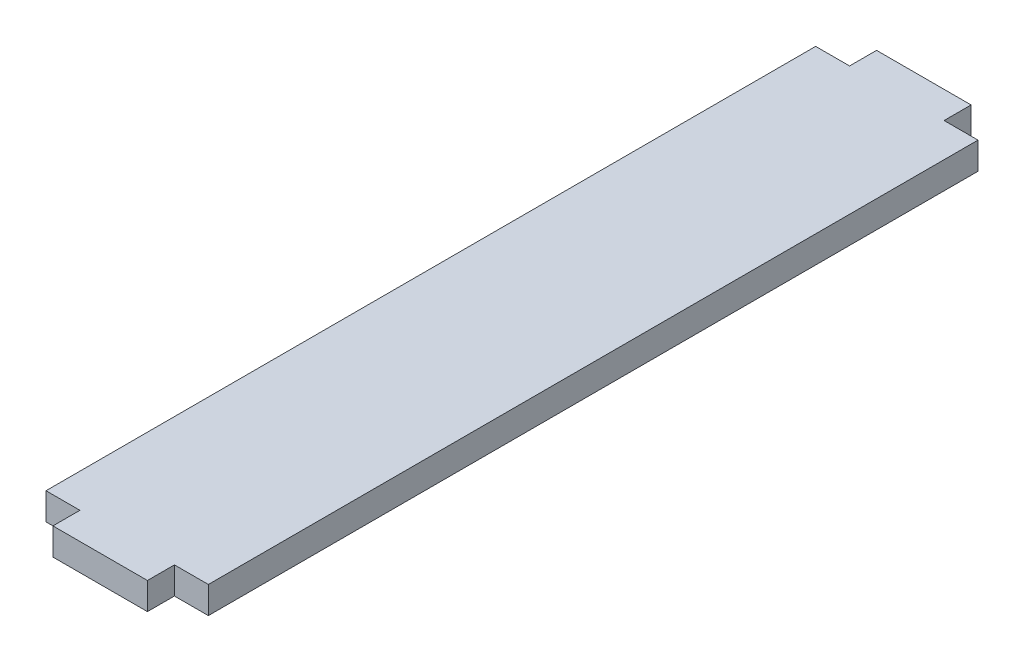
ISO-10303-21;
HEADER;
FILE_DESCRIPTION(('STEP AP214'),'2;1');
FILE_NAME('part.step','',(''),(''),'','','');
FILE_SCHEMA(('AUTOMOTIVE_DESIGN { 1 0 10303 214 1 1 1 1 }'));
ENDSEC;
DATA;
#1=APPLICATION_CONTEXT('core data for automotive mechanical design processes');
#2=APPLICATION_PROTOCOL_DEFINITION('international standard','automotive_design',2000,#1);
#3=PRODUCT_CONTEXT('',#1,'mechanical');
#4=PRODUCT('Part','Part','',(#3));
#5=PRODUCT_RELATED_PRODUCT_CATEGORY('part','',(#4));
#6=PRODUCT_DEFINITION_FORMATION('','',#4);
#7=PRODUCT_DEFINITION_CONTEXT('part definition',#1,'design');
#8=PRODUCT_DEFINITION('design','',#6,#7);
#9=PRODUCT_DEFINITION_SHAPE('','',#8);
#10=(LENGTH_UNIT() NAMED_UNIT(*) SI_UNIT(.MILLI.,.METRE.));
#11=(NAMED_UNIT(*) PLANE_ANGLE_UNIT() SI_UNIT($,.RADIAN.));
#12=(NAMED_UNIT(*) SI_UNIT($,.STERADIAN.) SOLID_ANGLE_UNIT());
#13=UNCERTAINTY_MEASURE_WITH_UNIT(LENGTH_MEASURE(1.E-05),#10,'distance_accuracy_value','');
#14=(GEOMETRIC_REPRESENTATION_CONTEXT(3) GLOBAL_UNCERTAINTY_ASSIGNED_CONTEXT((#13)) GLOBAL_UNIT_ASSIGNED_CONTEXT((#10,
#11,#12)) REPRESENTATION_CONTEXT('',''));
#15=CARTESIAN_POINT('',(0.,0.,0.));
#16=DIRECTION('',(0.,0.,1.));
#17=DIRECTION('',(1.,0.,0.));
#18=AXIS2_PLACEMENT_3D('',#15,#16,#17);
#19=CARTESIAN_POINT('',(0.,5.08,-144.78));
#20=DIRECTION('',(0.,0.,1.));
#21=DIRECTION('',(1.,0.,0.));
#22=AXIS2_PLACEMENT_3D('',#19,#20,#21);
#23=PLANE('',#22);
#24=DIRECTION('',(0.,1.,0.));
#25=VECTOR('',#24,1.);
#26=CARTESIAN_POINT('',(-24.16,0.,-144.78));
#27=LINE('',#26,#25);
#28=CARTESIAN_POINT('',(-24.16,0.,-144.78));
#29=VERTEX_POINT('',#28);
#30=CARTESIAN_POINT('',(-24.16,5.08,-144.78));
#31=VERTEX_POINT('',#30);
#32=EDGE_CURVE('E144',#29,#31,#27,.T.);
#33=ORIENTED_EDGE('',*,*,#32,.F.);
#34=DIRECTION('',(-1.,0.,0.));
#35=VECTOR('',#34,1.);
#36=CARTESIAN_POINT('',(0.,0.,-144.78));
#37=LINE('',#36,#35);
#38=CARTESIAN_POINT('',(-30.54,0.,-144.78));
#39=VERTEX_POINT('',#38);
#40=EDGE_CURVE('E192',#29,#39,#37,.T.);
#41=ORIENTED_EDGE('',*,*,#40,.T.);
#42=DIRECTION('',(0.,-1.,0.));
#43=VECTOR('',#42,1.);
#44=CARTESIAN_POINT('',(-30.54,5.08,-144.78));
#45=LINE('',#44,#43);
#46=CARTESIAN_POINT('',(-30.54,5.08,-144.78));
#47=VERTEX_POINT('',#46);
#48=EDGE_CURVE('E41',#47,#39,#45,.T.);
#49=ORIENTED_EDGE('',*,*,#48,.F.);
#50=DIRECTION('',(-1.,0.,0.));
#51=VECTOR('',#50,1.);
#52=CARTESIAN_POINT('',(0.,5.08,-144.78));
#53=LINE('',#52,#51);
#54=EDGE_CURVE('E48',#31,#47,#53,.T.);
#55=ORIENTED_EDGE('',*,*,#54,.F.);
#56=EDGE_LOOP('',(#33,#41,#49,#55));
#57=FACE_BOUND('',#56,.T.);
#58=ADVANCED_FACE('F33',(#57),#23,.F.);
#59=DIRECTION('',(0.,-1.,0.));
#60=VECTOR('',#59,1.);
#61=CARTESIAN_POINT('',(-6.38,0.,-144.78));
#62=LINE('',#61,#60);
#63=CARTESIAN_POINT('',(-6.38,5.08,-144.78));
#64=VERTEX_POINT('',#63);
#65=CARTESIAN_POINT('',(-6.38,0.,-144.78));
#66=VERTEX_POINT('',#65);
#67=EDGE_CURVE('E56',#64,#66,#62,.T.);
#68=ORIENTED_EDGE('',*,*,#67,.F.);
#69=CARTESIAN_POINT('',(0.,5.08,-144.78));
#70=VERTEX_POINT('',#69);
#71=EDGE_CURVE('E181',#70,#64,#53,.T.);
#72=ORIENTED_EDGE('',*,*,#71,.F.);
#73=DIRECTION('',(0.,-1.,0.));
#74=VECTOR('',#73,1.);
#75=CARTESIAN_POINT('',(0.,5.08,-144.78));
#76=LINE('',#75,#74);
#77=CARTESIAN_POINT('',(0.,0.,-144.78));
#78=VERTEX_POINT('',#77);
#79=EDGE_CURVE('E11',#70,#78,#76,.T.);
#80=ORIENTED_EDGE('',*,*,#79,.T.);
#81=EDGE_CURVE('E193',#78,#66,#37,.T.);
#82=ORIENTED_EDGE('',*,*,#81,.T.);
#83=EDGE_LOOP('',(#68,#72,#80,#82));
#84=FACE_BOUND('',#83,.T.);
#85=ADVANCED_FACE('F256',(#84),#23,.F.);
#86=CARTESIAN_POINT('',(0.,5.08,0.));
#87=DIRECTION('',(0.,0.,-1.));
#88=DIRECTION('',(-1.,0.,0.));
#89=AXIS2_PLACEMENT_3D('',#86,#87,#88);
#90=PLANE('',#89);
#91=DIRECTION('',(0.,1.,0.));
#92=VECTOR('',#91,1.);
#93=CARTESIAN_POINT('',(-6.38,0.,0.));
#94=LINE('',#93,#92);
#95=CARTESIAN_POINT('',(-6.38,0.,0.));
#96=VERTEX_POINT('',#95);
#97=CARTESIAN_POINT('',(-6.38,5.08,0.));
#98=VERTEX_POINT('',#97);
#99=EDGE_CURVE('E145',#96,#98,#94,.T.);
#100=ORIENTED_EDGE('',*,*,#99,.F.);
#101=DIRECTION('',(1.,0.,0.));
#102=VECTOR('',#101,1.);
#103=CARTESIAN_POINT('',(0.,0.,0.));
#104=LINE('',#103,#102);
#105=CARTESIAN_POINT('',(0.,0.,0.));
#106=VERTEX_POINT('',#105);
#107=EDGE_CURVE('E197',#96,#106,#104,.T.);
#108=ORIENTED_EDGE('',*,*,#107,.T.);
#109=DIRECTION('',(0.,-1.,0.));
#110=VECTOR('',#109,1.);
#111=CARTESIAN_POINT('',(0.,5.08,0.));
#112=LINE('',#111,#110);
#113=CARTESIAN_POINT('',(0.,5.08,0.));
#114=VERTEX_POINT('',#113);
#115=EDGE_CURVE('E189',#114,#106,#112,.T.);
#116=ORIENTED_EDGE('',*,*,#115,.F.);
#117=DIRECTION('',(1.,0.,0.));
#118=VECTOR('',#117,1.);
#119=CARTESIAN_POINT('',(0.,5.08,0.));
#120=LINE('',#119,#118);
#121=EDGE_CURVE('E185',#98,#114,#120,.T.);
#122=ORIENTED_EDGE('',*,*,#121,.F.);
#123=EDGE_LOOP('',(#100,#108,#116,#122));
#124=FACE_BOUND('',#123,.T.);
#125=ADVANCED_FACE('F232',(#124),#90,.F.);
#126=DIRECTION('',(0.,-1.,0.));
#127=VECTOR('',#126,1.);
#128=CARTESIAN_POINT('',(-24.16,0.,0.));
#129=LINE('',#128,#127);
#130=CARTESIAN_POINT('',(-24.16,5.08,0.));
#131=VERTEX_POINT('',#130);
#132=CARTESIAN_POINT('',(-24.16,0.,0.));
#133=VERTEX_POINT('',#132);
#134=EDGE_CURVE('E148',#131,#133,#129,.T.);
#135=ORIENTED_EDGE('',*,*,#134,.F.);
#136=CARTESIAN_POINT('',(-30.54,5.08,0.));
#137=VERTEX_POINT('',#136);
#138=EDGE_CURVE('E186',#137,#131,#120,.T.);
#139=ORIENTED_EDGE('',*,*,#138,.F.);
#140=DIRECTION('',(0.,-1.,0.));
#141=VECTOR('',#140,1.);
#142=CARTESIAN_POINT('',(-30.54,5.08,0.));
#143=LINE('',#142,#141);
#144=CARTESIAN_POINT('',(-30.54,0.,0.));
#145=VERTEX_POINT('',#144);
#146=EDGE_CURVE('E201',#137,#145,#143,.T.);
#147=ORIENTED_EDGE('',*,*,#146,.T.);
#148=EDGE_CURVE('E180',#145,#133,#104,.T.);
#149=ORIENTED_EDGE('',*,*,#148,.T.);
#150=EDGE_LOOP('',(#135,#139,#147,#149));
#151=FACE_BOUND('',#150,.T.);
#152=ADVANCED_FACE('F217',(#151),#90,.F.);
#153=CARTESIAN_POINT('',(0.,5.08,0.));
#154=DIRECTION('',(-1.,0.,0.));
#155=DIRECTION('',(0.,0.,1.));
#156=AXIS2_PLACEMENT_3D('',#153,#154,#155);
#157=PLANE('',#156);
#158=DIRECTION('',(0.,0.,-1.));
#159=VECTOR('',#158,1.);
#160=CARTESIAN_POINT('',(0.,0.,0.));
#161=LINE('',#160,#159);
#162=EDGE_CURVE('E177',#106,#78,#161,.T.);
#163=ORIENTED_EDGE('',*,*,#162,.T.);
#164=ORIENTED_EDGE('',*,*,#79,.F.);
#165=DIRECTION('',(0.,0.,-1.));
#166=VECTOR('',#165,1.);
#167=CARTESIAN_POINT('',(0.,5.08,0.));
#168=LINE('',#167,#166);
#169=EDGE_CURVE('E178',#114,#70,#168,.T.);
#170=ORIENTED_EDGE('',*,*,#169,.F.);
#171=ORIENTED_EDGE('',*,*,#115,.T.);
#172=EDGE_LOOP('',(#163,#164,#170,#171));
#173=FACE_BOUND('',#172,.T.);
#174=ADVANCED_FACE('F35',(#173),#157,.F.);
#175=CARTESIAN_POINT('',(-30.54,5.08,0.));
#176=DIRECTION('',(1.,0.,0.));
#177=DIRECTION('',(0.,0.,-1.));
#178=AXIS2_PLACEMENT_3D('',#175,#176,#177);
#179=PLANE('',#178);
#180=DIRECTION('',(0.,0.,1.));
#181=VECTOR('',#180,1.);
#182=CARTESIAN_POINT('',(-30.54,0.,0.));
#183=LINE('',#182,#181);
#184=EDGE_CURVE('E195',#39,#145,#183,.T.);
#185=ORIENTED_EDGE('',*,*,#184,.T.);
#186=ORIENTED_EDGE('',*,*,#146,.F.);
#187=DIRECTION('',(0.,0.,1.));
#188=VECTOR('',#187,1.);
#189=CARTESIAN_POINT('',(-30.54,5.08,0.));
#190=LINE('',#189,#188);
#191=EDGE_CURVE('E183',#47,#137,#190,.T.);
#192=ORIENTED_EDGE('',*,*,#191,.F.);
#193=ORIENTED_EDGE('',*,*,#48,.T.);
#194=EDGE_LOOP('',(#185,#186,#192,#193));
#195=FACE_BOUND('',#194,.T.);
#196=ADVANCED_FACE('F207',(#195),#179,.F.);
#197=CARTESIAN_POINT('',(0.,5.08,0.));
#198=DIRECTION('',(0.,1.,0.));
#199=DIRECTION('',(0.,0.,1.));
#200=AXIS2_PLACEMENT_3D('',#197,#198,#199);
#201=PLANE('',#200);
#202=ORIENTED_EDGE('',*,*,#169,.T.);
#203=ORIENTED_EDGE('',*,*,#71,.T.);
#204=DIRECTION('',(0.,0.,1.));
#205=VECTOR('',#204,1.);
#206=CARTESIAN_POINT('',(-6.38,5.08,-149.86));
#207=LINE('',#206,#205);
#208=CARTESIAN_POINT('',(-6.38,5.08,-149.86));
#209=VERTEX_POINT('',#208);
#210=EDGE_CURVE('E129',#209,#64,#207,.T.);
#211=ORIENTED_EDGE('',*,*,#210,.F.);
#212=DIRECTION('',(1.,0.,0.));
#213=VECTOR('',#212,1.);
#214=CARTESIAN_POINT('',(-24.16,5.08,-149.86));
#215=LINE('',#214,#213);
#216=CARTESIAN_POINT('',(-24.16,5.08,-149.86));
#217=VERTEX_POINT('',#216);
#218=EDGE_CURVE('E121',#217,#209,#215,.T.);
#219=ORIENTED_EDGE('',*,*,#218,.F.);
#220=DIRECTION('',(0.,0.,1.));
#221=VECTOR('',#220,1.);
#222=CARTESIAN_POINT('',(-24.16,5.08,-149.86));
#223=LINE('',#222,#221);
#224=EDGE_CURVE('E126',#217,#31,#223,.T.);
#225=ORIENTED_EDGE('',*,*,#224,.T.);
#226=ORIENTED_EDGE('',*,*,#54,.T.);
#227=ORIENTED_EDGE('',*,*,#191,.T.);
#228=ORIENTED_EDGE('',*,*,#138,.T.);
#229=DIRECTION('',(0.,0.,-1.));
#230=VECTOR('',#229,1.);
#231=CARTESIAN_POINT('',(-24.16,5.08,5.08));
#232=LINE('',#231,#230);
#233=CARTESIAN_POINT('',(-24.16,5.08,5.08));
#234=VERTEX_POINT('',#233);
#235=EDGE_CURVE('E171',#234,#131,#232,.T.);
#236=ORIENTED_EDGE('',*,*,#235,.F.);
#237=DIRECTION('',(-1.,0.,0.));
#238=VECTOR('',#237,1.);
#239=CARTESIAN_POINT('',(-24.16,5.08,5.08));
#240=LINE('',#239,#238);
#241=CARTESIAN_POINT('',(-6.38,5.08,5.08));
#242=VERTEX_POINT('',#241);
#243=EDGE_CURVE('E157',#242,#234,#240,.T.);
#244=ORIENTED_EDGE('',*,*,#243,.F.);
#245=DIRECTION('',(0.,0.,-1.));
#246=VECTOR('',#245,1.);
#247=CARTESIAN_POINT('',(-6.38,5.08,5.08));
#248=LINE('',#247,#246);
#249=EDGE_CURVE('E174',#242,#98,#248,.T.);
#250=ORIENTED_EDGE('',*,*,#249,.T.);
#251=ORIENTED_EDGE('',*,*,#121,.T.);
#252=EDGE_LOOP('',(#202,#203,#211,#219,#225,#226,#227,#228,#236,#244,#250,#251));
#253=FACE_BOUND('',#252,.T.);
#254=ADVANCED_FACE('F124',(#253),#201,.T.);
#255=CARTESIAN_POINT('',(0.,0.,0.));
#256=DIRECTION('',(0.,1.,0.));
#257=DIRECTION('',(0.,0.,1.));
#258=AXIS2_PLACEMENT_3D('',#255,#256,#257);
#259=PLANE('',#258);
#260=ORIENTED_EDGE('',*,*,#162,.F.);
#261=ORIENTED_EDGE('',*,*,#107,.F.);
#262=DIRECTION('',(0.,0.,-1.));
#263=VECTOR('',#262,1.);
#264=CARTESIAN_POINT('',(-6.38,0.,5.08));
#265=LINE('',#264,#263);
#266=CARTESIAN_POINT('',(-6.38,0.,5.08));
#267=VERTEX_POINT('',#266);
#268=EDGE_CURVE('E162',#267,#96,#265,.T.);
#269=ORIENTED_EDGE('',*,*,#268,.F.);
#270=DIRECTION('',(1.,0.,0.));
#271=VECTOR('',#270,1.);
#272=CARTESIAN_POINT('',(-24.16,0.,5.08));
#273=LINE('',#272,#271);
#274=CARTESIAN_POINT('',(-24.16,0.,5.08));
#275=VERTEX_POINT('',#274);
#276=EDGE_CURVE('E161',#275,#267,#273,.T.);
#277=ORIENTED_EDGE('',*,*,#276,.F.);
#278=DIRECTION('',(0.,0.,-1.));
#279=VECTOR('',#278,1.);
#280=CARTESIAN_POINT('',(-24.16,0.,5.08));
#281=LINE('',#280,#279);
#282=EDGE_CURVE('E168',#275,#133,#281,.T.);
#283=ORIENTED_EDGE('',*,*,#282,.T.);
#284=ORIENTED_EDGE('',*,*,#148,.F.);
#285=ORIENTED_EDGE('',*,*,#184,.F.);
#286=ORIENTED_EDGE('',*,*,#40,.F.);
#287=DIRECTION('',(0.,0.,1.));
#288=VECTOR('',#287,1.);
#289=CARTESIAN_POINT('',(-24.16,0.,-149.86));
#290=LINE('',#289,#288);
#291=CARTESIAN_POINT('',(-24.16,0.,-149.86));
#292=VERTEX_POINT('',#291);
#293=EDGE_CURVE('E242',#292,#29,#290,.T.);
#294=ORIENTED_EDGE('',*,*,#293,.F.);
#295=DIRECTION('',(-1.,0.,0.));
#296=VECTOR('',#295,1.);
#297=CARTESIAN_POINT('',(-24.16,0.,-149.86));
#298=LINE('',#297,#296);
#299=CARTESIAN_POINT('',(-6.38,0.,-149.86));
#300=VERTEX_POINT('',#299);
#301=EDGE_CURVE('E138',#300,#292,#298,.T.);
#302=ORIENTED_EDGE('',*,*,#301,.F.);
#303=DIRECTION('',(0.,0.,1.));
#304=VECTOR('',#303,1.);
#305=CARTESIAN_POINT('',(-6.38,0.,-149.86));
#306=LINE('',#305,#304);
#307=EDGE_CURVE('E150',#300,#66,#306,.T.);
#308=ORIENTED_EDGE('',*,*,#307,.T.);
#309=ORIENTED_EDGE('',*,*,#81,.F.);
#310=EDGE_LOOP('',(#260,#261,#269,#277,#283,#284,#285,#286,#294,#302,#308,#309));
#311=FACE_BOUND('',#310,.T.);
#312=ADVANCED_FACE('F213',(#311),#259,.F.);
#313=CARTESIAN_POINT('',(-6.38,0.,5.08));
#314=DIRECTION('',(-1.,0.,0.));
#315=DIRECTION('',(0.,-1.,0.));
#316=AXIS2_PLACEMENT_3D('',#313,#314,#315);
#317=PLANE('',#316);
#318=ORIENTED_EDGE('',*,*,#99,.T.);
#319=ORIENTED_EDGE('',*,*,#249,.F.);
#320=DIRECTION('',(0.,1.,0.));
#321=VECTOR('',#320,1.);
#322=CARTESIAN_POINT('',(-6.38,0.,5.08));
#323=LINE('',#322,#321);
#324=EDGE_CURVE('E154',#267,#242,#323,.T.);
#325=ORIENTED_EDGE('',*,*,#324,.F.);
#326=ORIENTED_EDGE('',*,*,#268,.T.);
#327=EDGE_LOOP('',(#318,#319,#325,#326));
#328=FACE_BOUND('',#327,.T.);
#329=ADVANCED_FACE('F229',(#328),#317,.F.);
#330=CARTESIAN_POINT('',(-24.16,0.,5.08));
#331=DIRECTION('',(1.,0.,0.));
#332=DIRECTION('',(0.,0.,-1.));
#333=AXIS2_PLACEMENT_3D('',#330,#331,#332);
#334=PLANE('',#333);
#335=ORIENTED_EDGE('',*,*,#134,.T.);
#336=ORIENTED_EDGE('',*,*,#282,.F.);
#337=DIRECTION('',(0.,-1.,0.));
#338=VECTOR('',#337,1.);
#339=CARTESIAN_POINT('',(-24.16,0.,5.08));
#340=LINE('',#339,#338);
#341=EDGE_CURVE('E159',#234,#275,#340,.T.);
#342=ORIENTED_EDGE('',*,*,#341,.F.);
#343=ORIENTED_EDGE('',*,*,#235,.T.);
#344=EDGE_LOOP('',(#335,#336,#342,#343));
#345=FACE_BOUND('',#344,.T.);
#346=ADVANCED_FACE('F220',(#345),#334,.F.);
#347=CARTESIAN_POINT('',(0.,0.,5.08));
#348=DIRECTION('',(0.,0.,-1.));
#349=DIRECTION('',(-1.,0.,0.));
#350=AXIS2_PLACEMENT_3D('',#347,#348,#349);
#351=PLANE('',#350);
#352=ORIENTED_EDGE('',*,*,#324,.T.);
#353=ORIENTED_EDGE('',*,*,#243,.T.);
#354=ORIENTED_EDGE('',*,*,#341,.T.);
#355=ORIENTED_EDGE('',*,*,#276,.T.);
#356=EDGE_LOOP('',(#352,#353,#354,#355));
#357=FACE_BOUND('',#356,.T.);
#358=ADVANCED_FACE('F226',(#357),#351,.F.);
#359=CARTESIAN_POINT('',(-24.16,0.,-149.86));
#360=DIRECTION('',(1.,0.,0.));
#361=DIRECTION('',(0.,0.,-1.));
#362=AXIS2_PLACEMENT_3D('',#359,#360,#361);
#363=PLANE('',#362);
#364=ORIENTED_EDGE('',*,*,#32,.T.);
#365=ORIENTED_EDGE('',*,*,#224,.F.);
#366=DIRECTION('',(0.,1.,0.));
#367=VECTOR('',#366,1.);
#368=CARTESIAN_POINT('',(-24.16,0.,-149.86));
#369=LINE('',#368,#367);
#370=EDGE_CURVE('E133',#292,#217,#369,.T.);
#371=ORIENTED_EDGE('',*,*,#370,.F.);
#372=ORIENTED_EDGE('',*,*,#293,.T.);
#373=EDGE_LOOP('',(#364,#365,#371,#372));
#374=FACE_BOUND('',#373,.T.);
#375=ADVANCED_FACE('F143',(#374),#363,.F.);
#376=CARTESIAN_POINT('',(-6.38,0.,-149.86));
#377=DIRECTION('',(-1.,0.,0.));
#378=DIRECTION('',(0.,0.,1.));
#379=AXIS2_PLACEMENT_3D('',#376,#377,#378);
#380=PLANE('',#379);
#381=ORIENTED_EDGE('',*,*,#67,.T.);
#382=ORIENTED_EDGE('',*,*,#307,.F.);
#383=DIRECTION('',(0.,-1.,0.));
#384=VECTOR('',#383,1.);
#385=CARTESIAN_POINT('',(-6.38,0.,-149.86));
#386=LINE('',#385,#384);
#387=EDGE_CURVE('E132',#209,#300,#386,.T.);
#388=ORIENTED_EDGE('',*,*,#387,.F.);
#389=ORIENTED_EDGE('',*,*,#210,.T.);
#390=EDGE_LOOP('',(#381,#382,#388,#389));
#391=FACE_BOUND('',#390,.T.);
#392=ADVANCED_FACE('F239',(#391),#380,.F.);
#393=CARTESIAN_POINT('',(0.,0.,-149.86));
#394=DIRECTION('',(0.,0.,-1.));
#395=DIRECTION('',(-1.,0.,0.));
#396=AXIS2_PLACEMENT_3D('',#393,#394,#395);
#397=PLANE('',#396);
#398=ORIENTED_EDGE('',*,*,#370,.T.);
#399=ORIENTED_EDGE('',*,*,#218,.T.);
#400=ORIENTED_EDGE('',*,*,#387,.T.);
#401=ORIENTED_EDGE('',*,*,#301,.T.);
#402=EDGE_LOOP('',(#398,#399,#400,#401));
#403=FACE_BOUND('',#402,.T.);
#404=ADVANCED_FACE('F136',(#403),#397,.T.);
#405=CLOSED_SHELL('',(#58,#85,#125,#152,#174,#196,#254,#312,#329,#346,#358,#375,#392,#404));
#406=MANIFOLD_SOLID_BREP('B2',#405);
#407=ADVANCED_BREP_SHAPE_REPRESENTATION('',(#18,#406),#14);
#408=SHAPE_DEFINITION_REPRESENTATION(#9,#407);
ENDSEC;
END-ISO-10303-21;
